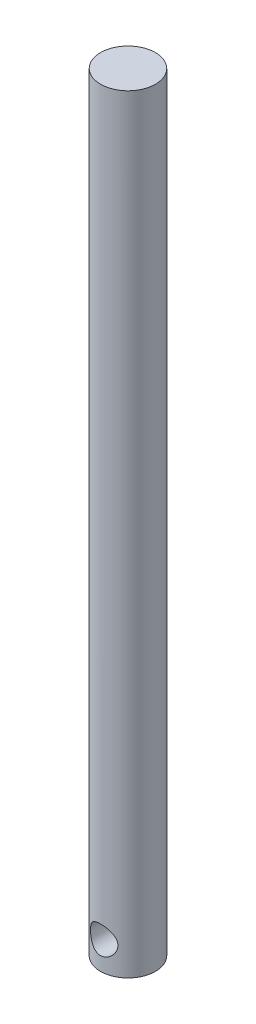
ISO-10303-21;
HEADER;
FILE_DESCRIPTION(('STEP AP214'),'2;1');
FILE_NAME('part.step','',(''),(''),'','','');
FILE_SCHEMA(('AUTOMOTIVE_DESIGN { 1 0 10303 214 1 1 1 1 }'));
ENDSEC;
DATA;
#1=APPLICATION_CONTEXT('core data for automotive mechanical design processes');
#2=APPLICATION_PROTOCOL_DEFINITION('international standard','automotive_design',2000,#1);
#3=PRODUCT_CONTEXT('',#1,'mechanical');
#4=PRODUCT('Part','Part','',(#3));
#5=PRODUCT_RELATED_PRODUCT_CATEGORY('part','',(#4));
#6=PRODUCT_DEFINITION_FORMATION('','',#4);
#7=PRODUCT_DEFINITION_CONTEXT('part definition',#1,'design');
#8=PRODUCT_DEFINITION('design','',#6,#7);
#9=PRODUCT_DEFINITION_SHAPE('','',#8);
#10=(LENGTH_UNIT() NAMED_UNIT(*) SI_UNIT(.MILLI.,.METRE.));
#11=(NAMED_UNIT(*) PLANE_ANGLE_UNIT() SI_UNIT($,.RADIAN.));
#12=(NAMED_UNIT(*) SI_UNIT($,.STERADIAN.) SOLID_ANGLE_UNIT());
#13=UNCERTAINTY_MEASURE_WITH_UNIT(LENGTH_MEASURE(1.E-05),#10,'distance_accuracy_value','');
#14=(GEOMETRIC_REPRESENTATION_CONTEXT(3) GLOBAL_UNCERTAINTY_ASSIGNED_CONTEXT((#13)) GLOBAL_UNIT_ASSIGNED_CONTEXT((#10,
#11,#12)) REPRESENTATION_CONTEXT('',''));
#15=CARTESIAN_POINT('',(0.,0.,0.));
#16=DIRECTION('',(0.,0.,1.));
#17=DIRECTION('',(1.,0.,0.));
#18=AXIS2_PLACEMENT_3D('',#15,#16,#17);
#19=CARTESIAN_POINT('',(0.,177.8,0.));
#20=DIRECTION('',(0.,-1.,0.));
#21=DIRECTION('',(0.,0.,-1.));
#22=AXIS2_PLACEMENT_3D('',#19,#20,#21);
#23=CYLINDRICAL_SURFACE('',#22,6.35);
#24=CARTESIAN_POINT('',(0.,9.525,-6.35));
#25=CARTESIAN_POINT('',(-0.0834969220594999,9.52499911228237,-6.34999931166444));
#26=CARTESIAN_POINT('',(-0.167002655580042,9.52170012555404,-6.34834758911701));
#27=CARTESIAN_POINT('',(-0.333378330258781,9.50855412545011,-6.34179105821714));
#28=CARTESIAN_POINT('',(-0.416247978955772,9.49870426347423,-6.33688483467113));
#29=CARTESIAN_POINT('',(-0.66318203064701,9.45942793495399,-6.31742426748325));
#30=CARTESIAN_POINT('',(-0.825450146761554,9.4202749225986,-6.29812827299425));
#31=CARTESIAN_POINT('',(-1.13965128900426,9.31800928870585,-6.2489182313574));
#32=CARTESIAN_POINT('',(-1.29162180811868,9.25498978075659,-6.21904547786825));
#33=CARTESIAN_POINT('',(-1.58264035037879,9.1072639263711,-6.15142812041637));
#34=CARTESIAN_POINT('',(-1.72168939123018,9.02255928984904,-6.11368413715877));
#35=CARTESIAN_POINT('',(-1.99234108848171,8.82803037026578,-6.03111096182982));
#36=CARTESIAN_POINT('',(-2.12298433900092,8.71699642220607,-5.98599127270818));
#37=CARTESIAN_POINT('',(-2.36467069069854,8.47560331642721,-5.89470535591056));
#38=CARTESIAN_POINT('',(-2.47569885601321,8.34522957023356,-5.84853836069043));
#39=CARTESIAN_POINT('',(-2.68368848497886,8.05657905224668,-5.75623634934464));
#40=CARTESIAN_POINT('',(-2.77889135161934,7.89692246869841,-5.71038146176788));
#41=CARTESIAN_POINT('',(-2.90019349951534,7.64545201282557,-5.64919759286363));
#42=CARTESIAN_POINT('',(-2.93705266116892,7.55959993817132,-5.63006420805933));
#43=CARTESIAN_POINT('',(-3.00322508739606,7.38441438629358,-5.59504604853267));
#44=CARTESIAN_POINT('',(-3.03254280972159,7.29508300181945,-5.57915935583429));
#45=CARTESIAN_POINT('',(-3.08174263292982,7.11898944803526,-5.55212611635049));
#46=CARTESIAN_POINT('',(-3.10208128111978,7.03238920597143,-5.54075429137746));
#47=CARTESIAN_POINT('',(-3.13545600360765,6.8574127210056,-5.52193654886444));
#48=CARTESIAN_POINT('',(-3.14849595237257,6.7690374462283,-5.51448854851135));
#49=CARTESIAN_POINT('',(-3.1670771305344,6.59129326115138,-5.50383875782918));
#50=CARTESIAN_POINT('',(-3.1726228759965,6.5019249820126,-5.50063441026522));
#51=CARTESIAN_POINT('',(-3.17614778806993,6.32301921582191,-5.49859788398609));
#52=CARTESIAN_POINT('',(-3.17412767659872,6.23348174572866,-5.49976528812799));
#53=CARTESIAN_POINT('',(-3.1581193033026,5.98725212427559,-5.50899190362733));
#54=CARTESIAN_POINT('',(-3.13621253452965,5.83115827018664,-5.52160857357707));
#55=CARTESIAN_POINT('',(-3.07003746372168,5.52535335869347,-5.55866493052824));
#56=CARTESIAN_POINT('',(-3.02576203854504,5.37564435097723,-5.58310838358077));
#57=CARTESIAN_POINT('',(-2.91531509833647,5.08245570343586,-5.64157885407236));
#58=CARTESIAN_POINT('',(-2.84865758129418,4.93920239006338,-5.67581583876129));
#59=CARTESIAN_POINT('',(-2.69570761526054,4.66523391382598,-5.75003268807633));
#60=CARTESIAN_POINT('',(-2.60940634674629,4.53452442039149,-5.79001512927804));
#61=CARTESIAN_POINT('',(-2.40685964249565,4.27189572574971,-5.87734289018611));
#62=CARTESIAN_POINT('',(-2.28820488335253,4.14192461514349,-5.92497898403936));
#63=CARTESIAN_POINT('',(-2.03058898448427,3.90291485713616,-6.01813700574905));
#64=CARTESIAN_POINT('',(-1.89161819563546,3.7938862136413,-6.06365791538158));
#65=CARTESIAN_POINT('',(-1.58913989972483,3.59509808028028,-6.1500381059768));
#66=CARTESIAN_POINT('',(-1.42479265164789,3.50646851442006,-6.19058274974572));
#67=CARTESIAN_POINT('',(-1.08098023585583,3.35884191836465,-6.25976272299952));
#68=CARTESIAN_POINT('',(-0.901527205073898,3.29982135886829,-6.28840750578946));
#69=CARTESIAN_POINT('',(-0.548533610626835,3.21794059660095,-6.32854759690358));
#70=CARTESIAN_POINT('',(-0.375734359385246,3.19249032741266,-6.34126679122995));
#71=CARTESIAN_POINT('',(-0.0278752299448329,3.17034947773974,-6.35231817716325));
#72=CARTESIAN_POINT('',(0.147183538060018,3.17364527286068,-6.35065718436129));
#73=CARTESIAN_POINT('',(0.480164686080361,3.20740623594539,-6.33384535408399));
#74=CARTESIAN_POINT('',(0.638363620564189,3.23574579147484,-6.31975005060431));
#75=CARTESIAN_POINT('',(0.947441883052999,3.31545587820989,-6.28085393924121));
#76=CARTESIAN_POINT('',(1.09832040207141,3.36682894847728,-6.25605195113515));
#77=CARTESIAN_POINT('',(1.39347133182512,3.4924951309378,-6.19709998236334));
#78=CARTESIAN_POINT('',(1.53743151047822,3.56740158411119,-6.16270299610718));
#79=CARTESIAN_POINT('',(1.8112148234104,3.73731642568587,-6.08787118465664));
#80=CARTESIAN_POINT('',(1.94103189959927,3.8323333773854,-6.0474337895468));
#81=CARTESIAN_POINT('',(2.19636241342679,4.05053935037377,-5.95973602709939));
#82=CARTESIAN_POINT('',(2.3202013468198,4.17557860711156,-5.91219559251098));
#83=CARTESIAN_POINT('',(2.54589381918874,4.44476235514975,-5.81858093231368));
#84=CARTESIAN_POINT('',(2.6477321493525,4.58891995238093,-5.77250773963547));
#85=CARTESIAN_POINT('',(2.83117262876716,4.90106860195835,-5.68487535288742));
#86=CARTESIAN_POINT('',(2.91155594998014,5.06987576951038,-5.64364281441821));
#87=CARTESIAN_POINT('',(3.04191297152938,5.42134446488967,-5.5744767953732));
#88=CARTESIAN_POINT('',(3.0919258549222,5.60398779784738,-5.54652618900869));
#89=CARTESIAN_POINT('',(3.15551086037918,5.95918995647017,-5.51057765714603));
#90=CARTESIAN_POINT('',(3.17212027309711,6.13103375040721,-5.50092192343245));
#91=CARTESIAN_POINT('',(3.17718805563876,6.4752444424952,-5.49800001145358));
#92=CARTESIAN_POINT('',(3.16565862768386,6.64761108154264,-5.50472672904441));
#93=CARTESIAN_POINT('',(3.11761548073658,6.97066010307391,-5.53205211477784));
#94=CARTESIAN_POINT('',(3.08358651207686,7.12184394173115,-5.55126823076269));
#95=CARTESIAN_POINT('',(2.99458164828807,7.41619083016717,-5.59977978302582));
#96=CARTESIAN_POINT('',(2.93959901505999,7.5593512828503,-5.62907846127335));
#97=CARTESIAN_POINT('',(2.8061154442137,7.84423369942855,-5.69685576337174));
#98=CARTESIAN_POINT('',(2.72628260503929,7.98521280936567,-5.73581889480533));
#99=CARTESIAN_POINT('',(2.54682759156583,8.2526974317231,-5.81772207082382));
#100=CARTESIAN_POINT('',(2.44719512169931,8.3791953599427,-5.8606641782013));
#101=CARTESIAN_POINT('',(2.21680287661219,8.63009752417706,-5.95192753761203));
#102=CARTESIAN_POINT('',(2.08373188558713,8.75237975641279,-6.00026839877346));
#103=CARTESIAN_POINT('',(1.79751265125244,8.97339787323311,-6.0921234557675));
#104=CARTESIAN_POINT('',(1.64435365457428,9.07212106598272,-6.13563504323042));
#105=CARTESIAN_POINT('',(1.40178715704487,9.20028026619707,-6.19391073190243));
#106=CARTESIAN_POINT('',(1.31842200030919,9.23980058368139,-6.21223173271383));
#107=CARTESIAN_POINT('',(1.14807701021671,9.3115994748237,-6.24595363475604));
#108=CARTESIAN_POINT('',(1.06109897786306,9.34388160653437,-6.26135597012704));
#109=CARTESIAN_POINT('',(0.884361322813108,9.400759345915,-6.28875097111981));
#110=CARTESIAN_POINT('',(0.794608244970573,9.42537171813811,-6.30075106809478));
#111=CARTESIAN_POINT('',(0.612925661591583,9.46666738952989,-6.32100983571903));
#112=CARTESIAN_POINT('',(0.520997521680291,9.48335553219354,-6.3292707916836));
#113=CARTESIAN_POINT('',(0.357531347524376,9.50561628486239,-6.34032503263334));
#114=CARTESIAN_POINT('',(0.286274046488597,9.51287882124963,-6.34394670812889));
#115=CARTESIAN_POINT('',(0.143346668941347,9.52257112653757,-6.34878452045567));
#116=CARTESIAN_POINT('',(0.071676581091426,9.52500076204682,-6.35000059089052));
#117=CARTESIAN_POINT('',(0.,9.525,-6.35));
#118=B_SPLINE_CURVE_WITH_KNOTS('',3,(#24,#25,#26,#27,#28,#29,#30,#31,#32,#33,#34,#35,#36,#37,
#38,#39,#40,#41,#42,#43,#44,#45,#46,#47,#48,#49,#50,#51,#52,#53,#54,#55,#56,#57,#58,#59,#60,#61,
#62,#63,#64,#65,#66,#67,#68,#69,#70,#71,#72,#73,#74,#75,#76,#77,#78,#79,#80,#81,#82,#83,#84,#85,
#86,#87,#88,#89,#90,#91,#92,#93,#94,#95,#96,#97,#98,#99,#100,#101,#102,#103,#104,#105,#106,#107,
#108,#109,#110,#111,#112,#113,#114,#115,#116,#117),.UNSPECIFIED.,.T.,.F.,(4,2,2,2,2,2,2,2,2,2,2,
2,2,2,2,2,2,2,2,2,2,2,2,2,2,2,2,2,2,2,2,2,2,2,2,2,2,2,2,2,2,2,2,2,2,2,4),(0.,0.25041561210268,
0.500940186864014,1.00234854488129,1.50182051324263,2.00125310940106,2.53090025348452,
3.06094897410615,3.63210298373098,3.91787290005988,4.20347350732849,4.47213270490103,
4.74064915090148,5.00900371453887,5.27733267302576,5.74927594687738,6.22136960256846,
6.70445970327764,7.18776712794021,7.73235646527881,8.27720530143646,8.84735553323665,
9.41705196489304,9.93956405039339,10.4618285011675,10.9436138594975,11.4254523397102,
11.9210677568139,12.4168946391879,12.9614122158798,13.5063050164601,14.0775857365549,
14.6481278321882,15.1639000911419,15.6794487286237,16.1458838633213,16.6124691169503,
17.1104020806943,17.6085946442304,18.1673210354482,18.7263477502426,19.0082017078365,
19.2899168101042,19.5710117490933,19.8519346536844,20.0668939492148,20.2818591776892),.UNSPECIFIED.);
#119=CARTESIAN_POINT('',(0.,9.525,-6.35));
#120=VERTEX_POINT('',#119);
#121=EDGE_CURVE('E10',#120,#120,#118,.T.);
#122=ORIENTED_EDGE('',*,*,#121,.T.);
#123=EDGE_LOOP('',(#122));
#124=FACE_BOUND('',#123,.T.);
#125=CARTESIAN_POINT('',(3.175,6.35,5.49926131403118));
#126=CARTESIAN_POINT('',(3.17499905676822,6.26723808646745,5.49926232876913));
#127=CARTESIAN_POINT('',(3.1717573852825,6.18446608495833,5.50113815093942));
#128=CARTESIAN_POINT('',(3.15884523354688,6.01957978714132,5.50856077670455));
#129=CARTESIAN_POINT('',(3.1491717603564,5.93746581504917,5.51410928932437));
#130=CARTESIAN_POINT('',(3.11062065473092,5.6928342515892,5.53601678924102));
#131=CARTESIAN_POINT('',(3.07221261154103,5.53217195301897,5.55763722742636));
#132=CARTESIAN_POINT('',(2.97211747978078,5.22140218785425,5.61178865498313));
#133=CARTESIAN_POINT('',(2.9105541372517,5.07124355981364,5.6442615458663));
#134=CARTESIAN_POINT('',(2.76627435445934,4.78338857719997,5.71635543890045));
#135=CARTESIAN_POINT('',(2.68355676984061,4.64569289736571,5.75597682772092));
#136=CARTESIAN_POINT('',(2.49131627779835,4.37417617866033,5.84190034267495));
#137=CARTESIAN_POINT('',(2.38014521787043,4.24161140271831,5.88848395338309));
#138=CARTESIAN_POINT('',(2.13758083606043,3.99602920874523,5.98081052060146));
#139=CARTESIAN_POINT('',(2.00617748851801,3.883021541095,6.02655304768282));
#140=CARTESIAN_POINT('',(1.71605436473863,3.67230904714995,6.11573187346572));
#141=CARTESIAN_POINT('',(1.55609032527602,3.57614922106035,6.15880487346127));
#142=CARTESIAN_POINT('',(1.21969855929243,3.41267785688862,6.23413651147239));
#143=CARTESIAN_POINT('',(1.04328130884119,3.34534811281404,6.26640197156108));
#144=CARTESIAN_POINT('',(0.692292696730402,3.24642268546146,6.31445464313237));
#145=CARTESIAN_POINT('',(0.518483183758178,3.21262525320581,6.33125099630315));
#146=CARTESIAN_POINT('',(0.166911747158855,3.17447257382175,6.35024078782237));
#147=CARTESIAN_POINT('',(-0.0108477196166793,3.17009951224336,6.35244306187831));
#148=CARTESIAN_POINT('',(-0.348718268640213,3.19007070120517,6.34247467450733));
#149=CARTESIAN_POINT('',(-0.509019820270689,3.21195074321593,6.33153724004097));
#150=CARTESIAN_POINT('',(-0.82332121295533,3.27939663545795,6.29838229153245));
#151=CARTESIAN_POINT('',(-0.977320581525265,3.32496425808659,6.27616393341038));
#152=CARTESIAN_POINT('',(-1.27733236684466,3.4387873140228,6.22209775234818));
#153=CARTESIAN_POINT('',(-1.42320480220676,3.50734792052068,6.19012095460315));
#154=CARTESIAN_POINT('',(-1.70172616219331,3.66478572001591,6.11942032404916));
#155=CARTESIAN_POINT('',(-1.83437032813194,3.75367018664773,6.08069407688628));
#156=CARTESIAN_POINT('',(-2.09605211974366,3.95889530158601,5.99580926070808));
#157=CARTESIAN_POINT('',(-2.22356359612797,4.07703709042908,5.94929416927823));
#158=CARTESIAN_POINT('',(-2.45777846555886,4.33256239352021,5.85642633307518));
#159=CARTESIAN_POINT('',(-2.56446584928023,4.46996057353959,5.81007373990265));
#160=CARTESIAN_POINT('',(-2.76069102698818,4.77094776836893,5.71957289604347));
#161=CARTESIAN_POINT('',(-2.84870951352547,4.93564591105867,5.67575155752789));
#162=CARTESIAN_POINT('',(-2.95849503046443,5.19383756613077,5.61885247415839));
#163=CARTESIAN_POINT('',(-2.99138760520285,5.28177792851171,5.60135560040996));
#164=CARTESIAN_POINT('',(-3.04938956554735,5.46079743821144,5.56999217748627));
#165=CARTESIAN_POINT('',(-3.07450375064138,5.55187461131915,5.55612339050229));
#166=CARTESIAN_POINT('',(-3.11492823782859,5.72915163140376,5.53355357587716));
#167=CARTESIAN_POINT('',(-3.13085491331031,5.81517064213338,5.52453156228568));
#168=CARTESIAN_POINT('',(-3.15556797554225,5.98851062758807,5.51045313491466));
#169=CARTESIAN_POINT('',(-3.16435807553686,6.07583090113364,5.50539465890766));
#170=CARTESIAN_POINT('',(-3.17466835867007,6.2510151488662,5.49945626530651));
#171=CARTESIAN_POINT('',(-3.17619124884848,6.33887890839041,5.49857479177741));
#172=CARTESIAN_POINT('',(-3.17195985852084,6.51434483764259,5.50101508803298));
#173=CARTESIAN_POINT('',(-3.16620606921981,6.60194702462764,5.50433657410105));
#174=CARTESIAN_POINT('',(-3.14018226453034,6.84409258564518,5.51925588435845));
#175=CARTESIAN_POINT('',(-3.11209439281024,6.99760560752863,5.53528611699027));
#176=CARTESIAN_POINT('',(-3.0343376295836,7.29734688059335,5.57828096923592));
#177=CARTESIAN_POINT('',(-2.98466174914483,7.44357275552032,5.60524912972109));
#178=CARTESIAN_POINT('',(-2.86273054239685,7.73242262664859,5.66852625788959));
#179=CARTESIAN_POINT('',(-2.78953600385261,7.87456613203184,5.70520999770139));
#180=CARTESIAN_POINT('',(-2.62346157669833,8.14536718477072,5.7834564691364));
#181=CARTESIAN_POINT('',(-2.53057157570877,8.27401775344213,5.82502170218951));
#182=CARTESIAN_POINT('',(-2.31405795861388,8.53115687151872,5.91464405440152));
#183=CARTESIAN_POINT('',(-2.18803622695199,8.65758076170252,5.96285904289681));
#184=CARTESIAN_POINT('',(-1.91580928554187,8.88813404752037,6.0558119327906));
#185=CARTESIAN_POINT('',(-1.76959728537411,8.99225591232324,6.10054865642871));
#186=CARTESIAN_POINT('',(-1.45584977269243,9.17757152668211,6.18303824145362));
#187=CARTESIAN_POINT('',(-1.28785333421913,9.25808763682627,6.22057562531784));
#188=CARTESIAN_POINT('',(-0.938283508313609,9.38891285822871,6.28279651772886));
#189=CARTESIAN_POINT('',(-0.756722200806243,9.43924849387441,6.30749131056505));
#190=CARTESIAN_POINT('',(-0.403160492410786,9.50394519054031,6.33944338582815));
#191=CARTESIAN_POINT('',(-0.231811338563333,9.52118326430183,6.34809271326659));
#192=CARTESIAN_POINT('',(0.111525009731683,9.52767735942549,6.35133763722966));
#193=CARTESIAN_POINT('',(0.28351195976931,9.51694317628552,6.3459381534549));
#194=CARTESIAN_POINT('',(0.611308110350747,9.46970294044204,6.32250351776756));
#195=CARTESIAN_POINT('',(0.767436553820506,9.43494172013717,6.30532443151586));
#196=CARTESIAN_POINT('',(1.07139095342116,9.34298666066607,6.26084894800281));
#197=CARTESIAN_POINT('',(1.21921571544173,9.28578960450921,6.23355109988091));
#198=CARTESIAN_POINT('',(1.50946910032131,9.14804206213775,6.16984840144776));
#199=CARTESIAN_POINT('',(1.65139651176319,9.0665973718741,6.13310397734646));
#200=CARTESIAN_POINT('',(1.92016030444462,8.88378184567064,6.05434784579293));
#201=CARTESIAN_POINT('',(2.04698971133066,8.78240185774526,6.0123337223239));
#202=CARTESIAN_POINT('',(2.29524860659569,8.55092616870492,5.92228494250573));
#203=CARTESIAN_POINT('',(2.41488454123001,8.41897676884794,5.87406724075615));
#204=CARTESIAN_POINT('',(2.63101905620371,8.1360662694591,5.78049654064408));
#205=CARTESIAN_POINT('',(2.7274971667743,7.98508852874211,5.73514610261339));
#206=CARTESIAN_POINT('',(2.85396050304135,7.74432051875563,5.67271720109896));
#207=CARTESIAN_POINT('',(2.89354057606826,7.66024227729361,5.65257123598791));
#208=CARTESIAN_POINT('',(2.96535747654718,7.48839277548245,5.61522862075768));
#209=CARTESIAN_POINT('',(2.99759808643801,7.4006234451167,5.59803045260694));
#210=CARTESIAN_POINT('',(3.0542719435453,7.22223099157535,5.5673118679383));
#211=CARTESIAN_POINT('',(3.07872527562275,7.13161588316956,5.55378200380455));
#212=CARTESIAN_POINT('',(3.11956903021308,6.94811152145907,5.53094387019911));
#213=CARTESIAN_POINT('',(3.13596509002515,6.85522390602568,5.52163264949546));
#214=CARTESIAN_POINT('',(3.15710761797221,6.69353625120406,5.50956192150408));
#215=CARTESIAN_POINT('',(3.16381073091702,6.62506632724011,5.5057086840578));
#216=CARTESIAN_POINT('',(3.17275746355016,6.487733281387,5.50055787263126));
#217=CARTESIAN_POINT('',(3.17500078490813,6.41887013350278,5.49926046961937));
#218=CARTESIAN_POINT('',(3.175,6.35,5.49926131403118));
#219=B_SPLINE_CURVE_WITH_KNOTS('',3,(#125,#126,#127,#128,#129,#130,#131,#132,#133,#134,#135,
#136,#137,#138,#139,#140,#141,#142,#143,#144,#145,#146,#147,#148,#149,#150,#151,#152,#153,#154,
#155,#156,#157,#158,#159,#160,#161,#162,#163,#164,#165,#166,#167,#168,#169,#170,#171,#172,#173,
#174,#175,#176,#177,#178,#179,#180,#181,#182,#183,#184,#185,#186,#187,#188,#189,#190,#191,#192,
#193,#194,#195,#196,#197,#198,#199,#200,#201,#202,#203,#204,#205,#206,#207,#208,#209,#210,#211,
#212,#213,#214,#215,#216,#217,#218),.UNSPECIFIED.,.T.,.F.,(4,2,2,2,2,2,2,2,2,2,2,2,2,2,2,2,2,2,
2,2,2,2,2,2,2,2,2,2,2,2,2,2,2,2,2,2,2,2,2,2,2,2,2,2,2,2,4),(0.,0.248210314193369,
0.496536210172845,0.993616655653378,1.48807751301481,1.98256512428753,2.51783706318107,
3.05337510292796,3.62501229957992,4.19628797710272,4.72691486873112,5.25722047303095,
5.74141031613327,6.22563639342838,6.71656194871309,7.20766347537031,7.74518754975546,
8.28312325280709,8.85521994590916,9.14138502893469,9.42737318655796,9.69083660833535,
9.95416285897606,10.2173910127766,10.4806013985705,10.9489167635524,11.4173838546846,
11.9075481007329,12.3979646273261,12.9502005485241,13.5026226528975,14.0696241997013,
14.6361266987681,15.1506510247058,15.6649951955482,16.1454469295095,16.625967578846,
17.1270402751829,17.6283435455375,18.1795366185793,18.7312151251733,19.0161455987001,
19.3009288973909,19.5849716229022,19.8688153329579,20.075349152287,20.2818967868888),.UNSPECIFIED.);
#220=CARTESIAN_POINT('',(3.175,6.35,5.49926131403118));
#221=VERTEX_POINT('',#220);
#222=EDGE_CURVE('E41',#221,#221,#219,.T.);
#223=ORIENTED_EDGE('',*,*,#222,.T.);
#224=EDGE_LOOP('',(#223));
#225=FACE_BOUND('',#224,.T.);
#226=CARTESIAN_POINT('',(0.,177.8,0.));
#227=DIRECTION('',(0.,1.,0.));
#228=DIRECTION('',(0.,0.,1.));
#229=AXIS2_PLACEMENT_3D('',#226,#227,#228);
#230=CIRCLE('',#229,6.35);
#231=CARTESIAN_POINT('',(0.,177.8,6.35));
#232=VERTEX_POINT('',#231);
#233=EDGE_CURVE('E45',#232,#232,#230,.T.);
#234=ORIENTED_EDGE('',*,*,#233,.F.);
#235=EDGE_LOOP('',(#234));
#236=FACE_BOUND('',#235,.T.);
#237=CARTESIAN_POINT('',(0.,0.,0.));
#238=DIRECTION('',(0.,1.,0.));
#239=DIRECTION('',(0.,0.,1.));
#240=AXIS2_PLACEMENT_3D('',#237,#238,#239);
#241=CIRCLE('',#240,6.35);
#242=CARTESIAN_POINT('',(0.,0.,6.35));
#243=VERTEX_POINT('',#242);
#244=EDGE_CURVE('E49',#243,#243,#241,.T.);
#245=ORIENTED_EDGE('',*,*,#244,.T.);
#246=EDGE_LOOP('',(#245));
#247=FACE_BOUND('',#246,.T.);
#248=ADVANCED_FACE('F31',(#124,#225,#236,#247),#23,.T.);
#249=CARTESIAN_POINT('',(0.,177.8,0.));
#250=DIRECTION('',(0.,1.,0.));
#251=DIRECTION('',(0.,0.,1.));
#252=AXIS2_PLACEMENT_3D('',#249,#250,#251);
#253=PLANE('',#252);
#254=ORIENTED_EDGE('',*,*,#233,.T.);
#255=EDGE_LOOP('',(#254));
#256=FACE_BOUND('',#255,.T.);
#257=ADVANCED_FACE('F60',(#256),#253,.T.);
#258=CARTESIAN_POINT('',(0.,0.,0.));
#259=DIRECTION('',(0.,1.,0.));
#260=DIRECTION('',(0.,0.,1.));
#261=AXIS2_PLACEMENT_3D('',#258,#259,#260);
#262=PLANE('',#261);
#263=ORIENTED_EDGE('',*,*,#244,.F.);
#264=EDGE_LOOP('',(#263));
#265=FACE_BOUND('',#264,.T.);
#266=ADVANCED_FACE('F58',(#265),#262,.F.);
#267=CARTESIAN_POINT('',(0.,6.35,-6.35));
#268=DIRECTION('',(0.,0.,1.));
#269=DIRECTION('',(1.,0.,0.));
#270=AXIS2_PLACEMENT_3D('',#267,#268,#269);
#271=CYLINDRICAL_SURFACE('',#270,3.175);
#272=ORIENTED_EDGE('',*,*,#222,.F.);
#273=EDGE_LOOP('',(#272));
#274=FACE_BOUND('',#273,.T.);
#275=ORIENTED_EDGE('',*,*,#121,.F.);
#276=EDGE_LOOP('',(#275));
#277=FACE_BOUND('',#276,.T.);
#278=ADVANCED_FACE('F54',(#274,#277),#271,.F.);
#279=CLOSED_SHELL('',(#248,#257,#266,#278));
#280=MANIFOLD_SOLID_BREP('B2',#279);
#281=ADVANCED_BREP_SHAPE_REPRESENTATION('',(#18,#280),#14);
#282=SHAPE_DEFINITION_REPRESENTATION(#9,#281);
ENDSEC;
END-ISO-10303-21;
